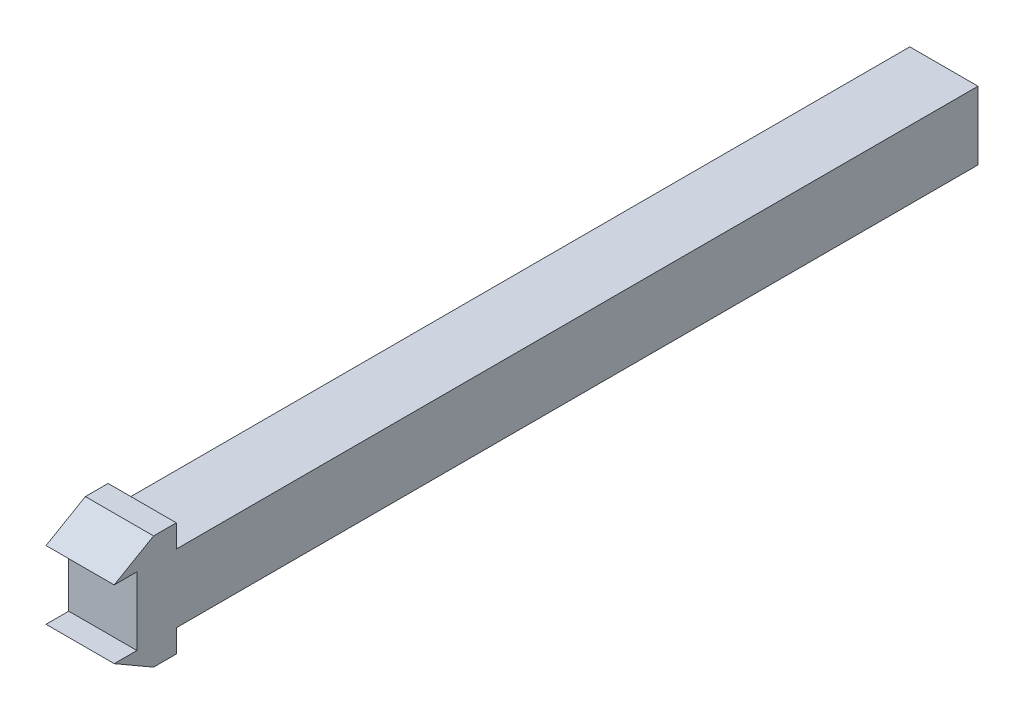
ISO-10303-21;
HEADER;
FILE_DESCRIPTION(('STEP AP214'),'2;1');
FILE_NAME('part.step','',(''),(''),'','','');
FILE_SCHEMA(('AUTOMOTIVE_DESIGN { 1 0 10303 214 1 1 1 1 }'));
ENDSEC;
DATA;
#1=APPLICATION_CONTEXT('core data for automotive mechanical design processes');
#2=APPLICATION_PROTOCOL_DEFINITION('international standard','automotive_design',2000,#1);
#3=PRODUCT_CONTEXT('',#1,'mechanical');
#4=PRODUCT('Part','Part','',(#3));
#5=PRODUCT_RELATED_PRODUCT_CATEGORY('part','',(#4));
#6=PRODUCT_DEFINITION_FORMATION('','',#4);
#7=PRODUCT_DEFINITION_CONTEXT('part definition',#1,'design');
#8=PRODUCT_DEFINITION('design','',#6,#7);
#9=PRODUCT_DEFINITION_SHAPE('','',#8);
#10=(LENGTH_UNIT() NAMED_UNIT(*) SI_UNIT(.MILLI.,.METRE.));
#11=(NAMED_UNIT(*) PLANE_ANGLE_UNIT() SI_UNIT($,.RADIAN.));
#12=(NAMED_UNIT(*) SI_UNIT($,.STERADIAN.) SOLID_ANGLE_UNIT());
#13=UNCERTAINTY_MEASURE_WITH_UNIT(LENGTH_MEASURE(1.E-05),#10,'distance_accuracy_value','');
#14=(GEOMETRIC_REPRESENTATION_CONTEXT(3) GLOBAL_UNCERTAINTY_ASSIGNED_CONTEXT((#13)) GLOBAL_UNIT_ASSIGNED_CONTEXT((#10,
#11,#12)) REPRESENTATION_CONTEXT('',''));
#15=CARTESIAN_POINT('',(0.,0.,0.));
#16=DIRECTION('',(0.,0.,1.));
#17=DIRECTION('',(1.,0.,0.));
#18=AXIS2_PLACEMENT_3D('',#15,#16,#17);
#19=CARTESIAN_POINT('',(-7.5,7.5,190.));
#20=DIRECTION('',(0.,-1.,0.));
#21=DIRECTION('',(0.,0.,-1.));
#22=AXIS2_PLACEMENT_3D('',#19,#20,#21);
#23=PLANE('',#22);
#24=DIRECTION('',(-1.,0.,0.));
#25=VECTOR('',#24,1.);
#26=CARTESIAN_POINT('',(22.046564555882,7.5,176.339745962156));
#27=LINE('',#26,#25);
#28=CARTESIAN_POINT('',(7.5,7.5,176.339745962156));
#29=VERTEX_POINT('',#28);
#30=CARTESIAN_POINT('',(-7.5,7.5,176.339745962156));
#31=VERTEX_POINT('',#30);
#32=EDGE_CURVE('E55',#29,#31,#27,.T.);
#33=ORIENTED_EDGE('',*,*,#32,.F.);
#34=DIRECTION('',(0.,0.,-1.));
#35=VECTOR('',#34,1.);
#36=CARTESIAN_POINT('',(7.5,7.5,190.));
#37=LINE('',#36,#35);
#38=CARTESIAN_POINT('',(7.5,7.5,0.));
#39=VERTEX_POINT('',#38);
#40=EDGE_CURVE('E11',#29,#39,#37,.T.);
#41=ORIENTED_EDGE('',*,*,#40,.T.);
#42=DIRECTION('',(-1.,0.,0.));
#43=VECTOR('',#42,1.);
#44=CARTESIAN_POINT('',(-7.5,7.5,0.));
#45=LINE('',#44,#43);
#46=CARTESIAN_POINT('',(-7.5,7.5,0.));
#47=VERTEX_POINT('',#46);
#48=EDGE_CURVE('E202',#39,#47,#45,.T.);
#49=ORIENTED_EDGE('',*,*,#48,.T.);
#50=DIRECTION('',(0.,0.,-1.));
#51=VECTOR('',#50,1.);
#52=CARTESIAN_POINT('',(-7.5,7.5,190.));
#53=LINE('',#52,#51);
#54=EDGE_CURVE('E41',#31,#47,#53,.T.);
#55=ORIENTED_EDGE('',*,*,#54,.F.);
#56=EDGE_LOOP('',(#33,#41,#49,#55));
#57=FACE_BOUND('',#56,.T.);
#58=ADVANCED_FACE('F33',(#57),#23,.F.);
#59=CARTESIAN_POINT('',(7.5,-7.5,190.));
#60=DIRECTION('',(-1.,0.,0.));
#61=DIRECTION('',(0.,0.,1.));
#62=AXIS2_PLACEMENT_3D('',#59,#60,#61);
#63=PLANE('',#62);
#64=DIRECTION('',(0.,1.,0.));
#65=VECTOR('',#64,1.);
#66=CARTESIAN_POINT('',(7.5,-7.5,185.));
#67=LINE('',#66,#65);
#68=CARTESIAN_POINT('',(7.5,-7.5,185.));
#69=VERTEX_POINT('',#68);
#70=CARTESIAN_POINT('',(7.5,7.5,185.));
#71=VERTEX_POINT('',#70);
#72=EDGE_CURVE('E138',#69,#71,#67,.T.);
#73=ORIENTED_EDGE('',*,*,#72,.F.);
#74=DIRECTION('',(0.,0.,1.));
#75=VECTOR('',#74,1.);
#76=CARTESIAN_POINT('',(7.5,-7.5,185.));
#77=LINE('',#76,#75);
#78=CARTESIAN_POINT('',(7.5,-7.5,190.));
#79=VERTEX_POINT('',#78);
#80=EDGE_CURVE('E121',#69,#79,#77,.T.);
#81=ORIENTED_EDGE('',*,*,#80,.T.);
#82=DIRECTION('',(0.,-0.500000000000002,-0.866025403784438));
#83=VECTOR('',#82,1.);
#84=CARTESIAN_POINT('',(7.5,-7.5,190.));
#85=LINE('',#84,#83);
#86=CARTESIAN_POINT('',(7.5,-12.5,181.339745962156));
#87=VERTEX_POINT('',#86);
#88=EDGE_CURVE('E161',#79,#87,#85,.T.);
#89=ORIENTED_EDGE('',*,*,#88,.T.);
#90=DIRECTION('',(0.,0.,-1.));
#91=VECTOR('',#90,1.);
#92=CARTESIAN_POINT('',(7.5,-12.5,181.339745962156));
#93=LINE('',#92,#91);
#94=CARTESIAN_POINT('',(7.5,-12.5,176.339745962156));
#95=VERTEX_POINT('',#94);
#96=EDGE_CURVE('E158',#87,#95,#93,.T.);
#97=ORIENTED_EDGE('',*,*,#96,.T.);
#98=DIRECTION('',(0.,1.,0.));
#99=VECTOR('',#98,1.);
#100=CARTESIAN_POINT('',(7.5,-12.5,176.339745962156));
#101=LINE('',#100,#99);
#102=CARTESIAN_POINT('',(7.5,-7.5,176.339745962156));
#103=VERTEX_POINT('',#102);
#104=EDGE_CURVE('E156',#95,#103,#101,.T.);
#105=ORIENTED_EDGE('',*,*,#104,.T.);
#106=DIRECTION('',(0.,0.,-1.));
#107=VECTOR('',#106,1.);
#108=CARTESIAN_POINT('',(7.5,-7.5,190.));
#109=LINE('',#108,#107);
#110=CARTESIAN_POINT('',(7.5,-7.5,0.));
#111=VERTEX_POINT('',#110);
#112=EDGE_CURVE('E199',#103,#111,#109,.T.);
#113=ORIENTED_EDGE('',*,*,#112,.T.);
#114=DIRECTION('',(0.,1.,0.));
#115=VECTOR('',#114,1.);
#116=CARTESIAN_POINT('',(7.5,-7.5,0.));
#117=LINE('',#116,#115);
#118=EDGE_CURVE('E194',#111,#39,#117,.T.);
#119=ORIENTED_EDGE('',*,*,#118,.T.);
#120=ORIENTED_EDGE('',*,*,#40,.F.);
#121=DIRECTION('',(0.,1.,0.));
#122=VECTOR('',#121,1.);
#123=CARTESIAN_POINT('',(7.5,12.5,176.339745962156));
#124=LINE('',#123,#122);
#125=CARTESIAN_POINT('',(7.5,12.5,176.339745962156));
#126=VERTEX_POINT('',#125);
#127=EDGE_CURVE('E177',#29,#126,#124,.T.);
#128=ORIENTED_EDGE('',*,*,#127,.T.);
#129=DIRECTION('',(0.,0.,1.));
#130=VECTOR('',#129,1.);
#131=CARTESIAN_POINT('',(7.5,12.5,181.339745962156));
#132=LINE('',#131,#130);
#133=CARTESIAN_POINT('',(7.5,12.5,181.339745962156));
#134=VERTEX_POINT('',#133);
#135=EDGE_CURVE('E175',#126,#134,#132,.T.);
#136=ORIENTED_EDGE('',*,*,#135,.T.);
#137=DIRECTION('',(0.,-0.500000000000002,0.866025403784438));
#138=VECTOR('',#137,1.);
#139=CARTESIAN_POINT('',(7.5,7.5,190.));
#140=LINE('',#139,#138);
#141=CARTESIAN_POINT('',(7.5,7.5,190.));
#142=VERTEX_POINT('',#141);
#143=EDGE_CURVE('E179',#134,#142,#140,.T.);
#144=ORIENTED_EDGE('',*,*,#143,.T.);
#145=DIRECTION('',(0.,0.,1.));
#146=VECTOR('',#145,1.);
#147=CARTESIAN_POINT('',(7.5,7.5,185.));
#148=LINE('',#147,#146);
#149=EDGE_CURVE('E131',#71,#142,#148,.T.);
#150=ORIENTED_EDGE('',*,*,#149,.F.);
#151=EDGE_LOOP('',(#73,#81,#89,#97,#105,#113,#119,#120,#128,#136,#144,#150));
#152=FACE_BOUND('',#151,.T.);
#153=ADVANCED_FACE('F35',(#152),#63,.F.);
#154=CARTESIAN_POINT('',(-7.5,-7.5,190.));
#155=DIRECTION('',(1.,0.,0.));
#156=DIRECTION('',(0.,0.,-1.));
#157=AXIS2_PLACEMENT_3D('',#154,#155,#156);
#158=PLANE('',#157);
#159=DIRECTION('',(0.,0.500000000000002,0.866025403784438));
#160=VECTOR('',#159,1.);
#161=CARTESIAN_POINT('',(-7.5,-7.5,190.));
#162=LINE('',#161,#160);
#163=CARTESIAN_POINT('',(-7.5,-12.5,181.339745962156));
#164=VERTEX_POINT('',#163);
#165=CARTESIAN_POINT('',(-7.5,-7.5,190.));
#166=VERTEX_POINT('',#165);
#167=EDGE_CURVE('E164',#164,#166,#162,.T.);
#168=ORIENTED_EDGE('',*,*,#167,.T.);
#169=DIRECTION('',(0.,0.,1.));
#170=VECTOR('',#169,1.);
#171=CARTESIAN_POINT('',(-7.5,-7.5,185.));
#172=LINE('',#171,#170);
#173=CARTESIAN_POINT('',(-7.5,-7.5,185.));
#174=VERTEX_POINT('',#173);
#175=EDGE_CURVE('E149',#174,#166,#172,.T.);
#176=ORIENTED_EDGE('',*,*,#175,.F.);
#177=DIRECTION('',(0.,-1.,0.));
#178=VECTOR('',#177,1.);
#179=CARTESIAN_POINT('',(-7.5,7.5,185.));
#180=LINE('',#179,#178);
#181=CARTESIAN_POINT('',(-7.5,7.5,185.));
#182=VERTEX_POINT('',#181);
#183=EDGE_CURVE('E132',#182,#174,#180,.T.);
#184=ORIENTED_EDGE('',*,*,#183,.F.);
#185=DIRECTION('',(0.,0.,1.));
#186=VECTOR('',#185,1.);
#187=CARTESIAN_POINT('',(-7.5,7.5,185.));
#188=LINE('',#187,#186);
#189=CARTESIAN_POINT('',(-7.5,7.5,190.));
#190=VERTEX_POINT('',#189);
#191=EDGE_CURVE('E152',#182,#190,#188,.T.);
#192=ORIENTED_EDGE('',*,*,#191,.T.);
#193=DIRECTION('',(0.,0.500000000000002,-0.866025403784438));
#194=VECTOR('',#193,1.);
#195=CARTESIAN_POINT('',(-7.5,7.5,190.));
#196=LINE('',#195,#194);
#197=CARTESIAN_POINT('',(-7.5,12.5,181.339745962156));
#198=VERTEX_POINT('',#197);
#199=EDGE_CURVE('E174',#190,#198,#196,.T.);
#200=ORIENTED_EDGE('',*,*,#199,.T.);
#201=DIRECTION('',(0.,0.,-1.));
#202=VECTOR('',#201,1.);
#203=CARTESIAN_POINT('',(-7.5,12.5,181.339745962156));
#204=LINE('',#203,#202);
#205=CARTESIAN_POINT('',(-7.5,12.5,176.339745962156));
#206=VERTEX_POINT('',#205);
#207=EDGE_CURVE('E182',#198,#206,#204,.T.);
#208=ORIENTED_EDGE('',*,*,#207,.T.);
#209=DIRECTION('',(0.,-1.,0.));
#210=VECTOR('',#209,1.);
#211=CARTESIAN_POINT('',(-7.5,12.5,176.339745962156));
#212=LINE('',#211,#210);
#213=EDGE_CURVE('E185',#206,#31,#212,.T.);
#214=ORIENTED_EDGE('',*,*,#213,.T.);
#215=ORIENTED_EDGE('',*,*,#54,.T.);
#216=DIRECTION('',(0.,-1.,0.));
#217=VECTOR('',#216,1.);
#218=CARTESIAN_POINT('',(-7.5,-7.5,0.));
#219=LINE('',#218,#217);
#220=CARTESIAN_POINT('',(-7.5,-7.5,0.));
#221=VERTEX_POINT('',#220);
#222=EDGE_CURVE('E205',#47,#221,#219,.T.);
#223=ORIENTED_EDGE('',*,*,#222,.T.);
#224=DIRECTION('',(0.,0.,-1.));
#225=VECTOR('',#224,1.);
#226=CARTESIAN_POINT('',(-7.5,-7.5,190.));
#227=LINE('',#226,#225);
#228=CARTESIAN_POINT('',(-7.5,-7.5,176.339745962156));
#229=VERTEX_POINT('',#228);
#230=EDGE_CURVE('E211',#229,#221,#227,.T.);
#231=ORIENTED_EDGE('',*,*,#230,.F.);
#232=DIRECTION('',(0.,-1.,0.));
#233=VECTOR('',#232,1.);
#234=CARTESIAN_POINT('',(-7.5,-12.5,176.339745962156));
#235=LINE('',#234,#233);
#236=CARTESIAN_POINT('',(-7.5,-12.5,176.339745962156));
#237=VERTEX_POINT('',#236);
#238=EDGE_CURVE('E48',#229,#237,#235,.T.);
#239=ORIENTED_EDGE('',*,*,#238,.T.);
#240=DIRECTION('',(0.,0.,1.));
#241=VECTOR('',#240,1.);
#242=CARTESIAN_POINT('',(-7.5,-12.5,181.339745962156));
#243=LINE('',#242,#241);
#244=EDGE_CURVE('E151',#237,#164,#243,.T.);
#245=ORIENTED_EDGE('',*,*,#244,.T.);
#246=EDGE_LOOP('',(#168,#176,#184,#192,#200,#208,#214,#215,#223,#231,#239,#245));
#247=FACE_BOUND('',#246,.T.);
#248=ADVANCED_FACE('F213',(#247),#158,.F.);
#249=CARTESIAN_POINT('',(-7.5,-7.5,190.));
#250=DIRECTION('',(0.,1.,0.));
#251=DIRECTION('',(0.,0.,1.));
#252=AXIS2_PLACEMENT_3D('',#249,#250,#251);
#253=PLANE('',#252);
#254=ORIENTED_EDGE('',*,*,#112,.F.);
#255=DIRECTION('',(-1.,0.,0.));
#256=VECTOR('',#255,1.);
#257=CARTESIAN_POINT('',(22.046564555882,-7.5,176.339745962156));
#258=LINE('',#257,#256);
#259=EDGE_CURVE('E170',#103,#229,#258,.T.);
#260=ORIENTED_EDGE('',*,*,#259,.T.);
#261=ORIENTED_EDGE('',*,*,#230,.T.);
#262=DIRECTION('',(1.,0.,0.));
#263=VECTOR('',#262,1.);
#264=CARTESIAN_POINT('',(-7.5,-7.5,0.));
#265=LINE('',#264,#263);
#266=EDGE_CURVE('E197',#221,#111,#265,.T.);
#267=ORIENTED_EDGE('',*,*,#266,.T.);
#268=EDGE_LOOP('',(#254,#260,#261,#267));
#269=FACE_BOUND('',#268,.T.);
#270=ADVANCED_FACE('F224',(#269),#253,.F.);
#271=CARTESIAN_POINT('',(0.,0.,0.));
#272=DIRECTION('',(0.,0.,-1.));
#273=DIRECTION('',(-1.,0.,0.));
#274=AXIS2_PLACEMENT_3D('',#271,#272,#273);
#275=PLANE('',#274);
#276=ORIENTED_EDGE('',*,*,#118,.F.);
#277=ORIENTED_EDGE('',*,*,#266,.F.);
#278=ORIENTED_EDGE('',*,*,#222,.F.);
#279=ORIENTED_EDGE('',*,*,#48,.F.);
#280=EDGE_LOOP('',(#276,#277,#278,#279));
#281=FACE_BOUND('',#280,.T.);
#282=ADVANCED_FACE('F221',(#281),#275,.T.);
#283=CARTESIAN_POINT('',(22.046564555882,12.5,176.339745962156));
#284=DIRECTION('',(0.,0.,-1.));
#285=DIRECTION('',(-1.,0.,0.));
#286=AXIS2_PLACEMENT_3D('',#283,#284,#285);
#287=PLANE('',#286);
#288=ORIENTED_EDGE('',*,*,#127,.F.);
#289=ORIENTED_EDGE('',*,*,#32,.T.);
#290=ORIENTED_EDGE('',*,*,#213,.F.);
#291=DIRECTION('',(-1.,0.,0.));
#292=VECTOR('',#291,1.);
#293=CARTESIAN_POINT('',(22.046564555882,12.5,176.339745962156));
#294=LINE('',#293,#292);
#295=EDGE_CURVE('E190',#126,#206,#294,.T.);
#296=ORIENTED_EDGE('',*,*,#295,.F.);
#297=EDGE_LOOP('',(#288,#289,#290,#296));
#298=FACE_BOUND('',#297,.T.);
#299=ADVANCED_FACE('F259',(#298),#287,.T.);
#300=CARTESIAN_POINT('',(22.046564555882,12.5,181.339745962156));
#301=DIRECTION('',(0.,1.,0.));
#302=DIRECTION('',(0.,0.,1.));
#303=AXIS2_PLACEMENT_3D('',#300,#301,#302);
#304=PLANE('',#303);
#305=ORIENTED_EDGE('',*,*,#135,.F.);
#306=ORIENTED_EDGE('',*,*,#295,.T.);
#307=ORIENTED_EDGE('',*,*,#207,.F.);
#308=DIRECTION('',(-1.,0.,0.));
#309=VECTOR('',#308,1.);
#310=CARTESIAN_POINT('',(22.046564555882,12.5,181.339745962156));
#311=LINE('',#310,#309);
#312=EDGE_CURVE('E188',#134,#198,#311,.T.);
#313=ORIENTED_EDGE('',*,*,#312,.F.);
#314=EDGE_LOOP('',(#305,#306,#307,#313));
#315=FACE_BOUND('',#314,.T.);
#316=ADVANCED_FACE('F262',(#315),#304,.T.);
#317=CARTESIAN_POINT('',(22.046564555882,7.5,190.));
#318=DIRECTION('',(0.,0.866025403784438,0.500000000000002));
#319=DIRECTION('',(0.,-0.500000000000002,0.866025403784438));
#320=AXIS2_PLACEMENT_3D('',#317,#318,#319);
#321=PLANE('',#320);
#322=ORIENTED_EDGE('',*,*,#143,.F.);
#323=ORIENTED_EDGE('',*,*,#312,.T.);
#324=ORIENTED_EDGE('',*,*,#199,.F.);
#325=DIRECTION('',(-1.,0.,0.));
#326=VECTOR('',#325,1.);
#327=CARTESIAN_POINT('',(-7.5,7.5,190.));
#328=LINE('',#327,#326);
#329=EDGE_CURVE('E195',#142,#190,#328,.T.);
#330=ORIENTED_EDGE('',*,*,#329,.F.);
#331=EDGE_LOOP('',(#322,#323,#324,#330));
#332=FACE_BOUND('',#331,.T.);
#333=ADVANCED_FACE('F244',(#332),#321,.T.);
#334=CARTESIAN_POINT('',(22.046564555882,-12.5,181.339745962156));
#335=DIRECTION('',(0.,-1.,0.));
#336=DIRECTION('',(0.,0.,-1.));
#337=AXIS2_PLACEMENT_3D('',#334,#335,#336);
#338=PLANE('',#337);
#339=ORIENTED_EDGE('',*,*,#96,.F.);
#340=DIRECTION('',(-1.,0.,0.));
#341=VECTOR('',#340,1.);
#342=CARTESIAN_POINT('',(22.046564555882,-12.5,181.339745962156));
#343=LINE('',#342,#341);
#344=EDGE_CURVE('E168',#87,#164,#343,.T.);
#345=ORIENTED_EDGE('',*,*,#344,.T.);
#346=ORIENTED_EDGE('',*,*,#244,.F.);
#347=DIRECTION('',(-1.,0.,0.));
#348=VECTOR('',#347,1.);
#349=CARTESIAN_POINT('',(22.046564555882,-12.5,176.339745962156));
#350=LINE('',#349,#348);
#351=EDGE_CURVE('E159',#95,#237,#350,.T.);
#352=ORIENTED_EDGE('',*,*,#351,.F.);
#353=EDGE_LOOP('',(#339,#345,#346,#352));
#354=FACE_BOUND('',#353,.T.);
#355=ADVANCED_FACE('F230',(#354),#338,.T.);
#356=CARTESIAN_POINT('',(22.046564555882,-12.5,176.339745962156));
#357=DIRECTION('',(0.,0.,-1.));
#358=DIRECTION('',(-1.,0.,0.));
#359=AXIS2_PLACEMENT_3D('',#356,#357,#358);
#360=PLANE('',#359);
#361=ORIENTED_EDGE('',*,*,#104,.F.);
#362=ORIENTED_EDGE('',*,*,#351,.T.);
#363=ORIENTED_EDGE('',*,*,#238,.F.);
#364=ORIENTED_EDGE('',*,*,#259,.F.);
#365=EDGE_LOOP('',(#361,#362,#363,#364));
#366=FACE_BOUND('',#365,.T.);
#367=ADVANCED_FACE('F235',(#366),#360,.T.);
#368=CARTESIAN_POINT('',(22.046564555882,-7.5,190.));
#369=DIRECTION('',(0.,-0.866025403784438,0.500000000000002));
#370=DIRECTION('',(0.,-0.500000000000002,-0.866025403784438));
#371=AXIS2_PLACEMENT_3D('',#368,#369,#370);
#372=PLANE('',#371);
#373=ORIENTED_EDGE('',*,*,#88,.F.);
#374=DIRECTION('',(1.,0.,0.));
#375=VECTOR('',#374,1.);
#376=CARTESIAN_POINT('',(-7.5,-7.5,190.));
#377=LINE('',#376,#375);
#378=EDGE_CURVE('E127',#166,#79,#377,.T.);
#379=ORIENTED_EDGE('',*,*,#378,.F.);
#380=ORIENTED_EDGE('',*,*,#167,.F.);
#381=ORIENTED_EDGE('',*,*,#344,.F.);
#382=EDGE_LOOP('',(#373,#379,#380,#381));
#383=FACE_BOUND('',#382,.T.);
#384=ADVANCED_FACE('F233',(#383),#372,.T.);
#385=CARTESIAN_POINT('',(-7.5,-7.5,185.));
#386=DIRECTION('',(0.,-1.,0.));
#387=DIRECTION('',(0.,0.,-1.));
#388=AXIS2_PLACEMENT_3D('',#385,#386,#387);
#389=PLANE('',#388);
#390=ORIENTED_EDGE('',*,*,#378,.T.);
#391=ORIENTED_EDGE('',*,*,#80,.F.);
#392=DIRECTION('',(1.,0.,0.));
#393=VECTOR('',#392,1.);
#394=CARTESIAN_POINT('',(-7.5,-7.5,185.));
#395=LINE('',#394,#393);
#396=EDGE_CURVE('E124',#174,#69,#395,.T.);
#397=ORIENTED_EDGE('',*,*,#396,.F.);
#398=ORIENTED_EDGE('',*,*,#175,.T.);
#399=EDGE_LOOP('',(#390,#391,#397,#398));
#400=FACE_BOUND('',#399,.T.);
#401=ADVANCED_FACE('F123',(#400),#389,.F.);
#402=CARTESIAN_POINT('',(7.5,7.5,185.));
#403=DIRECTION('',(0.,1.,0.));
#404=DIRECTION('',(0.,0.,1.));
#405=AXIS2_PLACEMENT_3D('',#402,#403,#404);
#406=PLANE('',#405);
#407=ORIENTED_EDGE('',*,*,#329,.T.);
#408=ORIENTED_EDGE('',*,*,#191,.F.);
#409=DIRECTION('',(-1.,0.,0.));
#410=VECTOR('',#409,1.);
#411=CARTESIAN_POINT('',(7.5,7.5,185.));
#412=LINE('',#411,#410);
#413=EDGE_CURVE('E144',#71,#182,#412,.T.);
#414=ORIENTED_EDGE('',*,*,#413,.F.);
#415=ORIENTED_EDGE('',*,*,#149,.T.);
#416=EDGE_LOOP('',(#407,#408,#414,#415));
#417=FACE_BOUND('',#416,.T.);
#418=ADVANCED_FACE('F280',(#417),#406,.F.);
#419=CARTESIAN_POINT('',(0.,0.,185.));
#420=DIRECTION('',(0.,0.,1.));
#421=DIRECTION('',(1.,0.,0.));
#422=AXIS2_PLACEMENT_3D('',#419,#420,#421);
#423=PLANE('',#422);
#424=ORIENTED_EDGE('',*,*,#396,.T.);
#425=ORIENTED_EDGE('',*,*,#72,.T.);
#426=ORIENTED_EDGE('',*,*,#413,.T.);
#427=ORIENTED_EDGE('',*,*,#183,.T.);
#428=EDGE_LOOP('',(#424,#425,#426,#427));
#429=FACE_BOUND('',#428,.T.);
#430=ADVANCED_FACE('F136',(#429),#423,.T.);
#431=CLOSED_SHELL('',(#58,#153,#248,#270,#282,#299,#316,#333,#355,#367,#384,#401,#418,#430));
#432=MANIFOLD_SOLID_BREP('B2',#431);
#433=ADVANCED_BREP_SHAPE_REPRESENTATION('',(#18,#432),#14);
#434=SHAPE_DEFINITION_REPRESENTATION(#9,#433);
ENDSEC;
END-ISO-10303-21;
